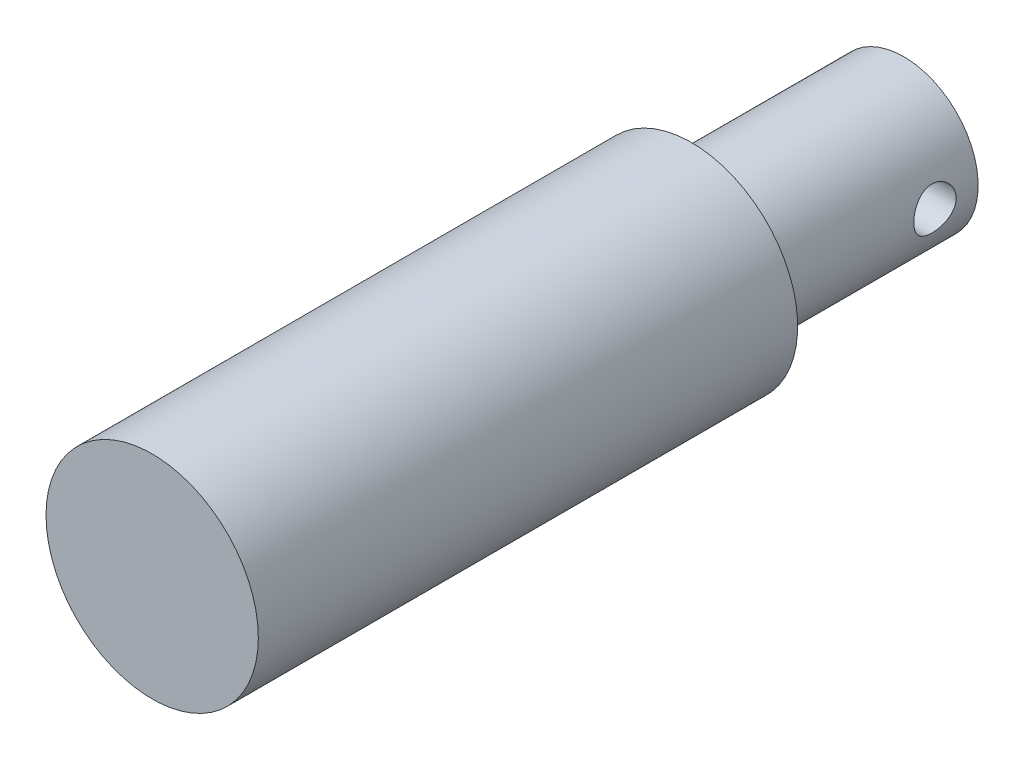
ISO-10303-21;
HEADER;
FILE_DESCRIPTION(('STEP AP214'),'2;1');
FILE_NAME('part.step','',(''),(''),'','','');
FILE_SCHEMA(('AUTOMOTIVE_DESIGN { 1 0 10303 214 1 1 1 1 }'));
ENDSEC;
DATA;
#1=APPLICATION_CONTEXT('core data for automotive mechanical design processes');
#2=APPLICATION_PROTOCOL_DEFINITION('international standard','automotive_design',2000,#1);
#3=PRODUCT_CONTEXT('',#1,'mechanical');
#4=PRODUCT('Part','Part','',(#3));
#5=PRODUCT_RELATED_PRODUCT_CATEGORY('part','',(#4));
#6=PRODUCT_DEFINITION_FORMATION('','',#4);
#7=PRODUCT_DEFINITION_CONTEXT('part definition',#1,'design');
#8=PRODUCT_DEFINITION('design','',#6,#7);
#9=PRODUCT_DEFINITION_SHAPE('','',#8);
#10=(LENGTH_UNIT() NAMED_UNIT(*) SI_UNIT(.MILLI.,.METRE.));
#11=(NAMED_UNIT(*) PLANE_ANGLE_UNIT() SI_UNIT($,.RADIAN.));
#12=(NAMED_UNIT(*) SI_UNIT($,.STERADIAN.) SOLID_ANGLE_UNIT());
#13=UNCERTAINTY_MEASURE_WITH_UNIT(LENGTH_MEASURE(1.E-05),#10,'distance_accuracy_value','');
#14=(GEOMETRIC_REPRESENTATION_CONTEXT(3) GLOBAL_UNCERTAINTY_ASSIGNED_CONTEXT((#13)) GLOBAL_UNIT_ASSIGNED_CONTEXT((#10,
#11,#12)) REPRESENTATION_CONTEXT('',''));
#15=CARTESIAN_POINT('',(0.,0.,0.));
#16=DIRECTION('',(0.,0.,1.));
#17=DIRECTION('',(1.,0.,0.));
#18=AXIS2_PLACEMENT_3D('',#15,#16,#17);
#19=CARTESIAN_POINT('',(0.,0.,35.4));
#20=DIRECTION('',(0.,0.,-1.));
#21=DIRECTION('',(-1.,0.,0.));
#22=AXIS2_PLACEMENT_3D('',#19,#20,#21);
#23=CYLINDRICAL_SURFACE('',#22,5.);
#24=CARTESIAN_POINT('',(0.,0.,35.4));
#25=DIRECTION('',(0.,0.,1.));
#26=DIRECTION('',(1.,0.,0.));
#27=AXIS2_PLACEMENT_3D('',#24,#25,#26);
#28=CIRCLE('',#27,5.);
#29=CARTESIAN_POINT('',(5.,0.,35.4));
#30=VERTEX_POINT('',#29);
#31=EDGE_CURVE('E11',#30,#30,#28,.T.);
#32=ORIENTED_EDGE('',*,*,#31,.F.);
#33=EDGE_LOOP('',(#32));
#34=FACE_BOUND('',#33,.T.);
#35=CARTESIAN_POINT('',(0.,0.,10.));
#36=DIRECTION('',(0.,0.,-1.));
#37=DIRECTION('',(-1.,0.,0.));
#38=AXIS2_PLACEMENT_3D('',#35,#36,#37);
#39=CIRCLE('',#38,5.);
#40=CARTESIAN_POINT('',(-5.,0.,10.));
#41=VERTEX_POINT('',#40);
#42=EDGE_CURVE('E35',#41,#41,#39,.T.);
#43=ORIENTED_EDGE('',*,*,#42,.F.);
#44=EDGE_LOOP('',(#43));
#45=FACE_BOUND('',#44,.T.);
#46=ADVANCED_FACE('F32',(#34,#45),#23,.T.);
#47=CARTESIAN_POINT('',(0.,0.,35.4));
#48=DIRECTION('',(0.,0.,1.));
#49=DIRECTION('',(1.,0.,0.));
#50=AXIS2_PLACEMENT_3D('',#47,#48,#49);
#51=PLANE('',#50);
#52=ORIENTED_EDGE('',*,*,#31,.T.);
#53=EDGE_LOOP('',(#52));
#54=FACE_BOUND('',#53,.T.);
#55=ADVANCED_FACE('F69',(#54),#51,.T.);
#56=CARTESIAN_POINT('',(0.,0.,10.));
#57=DIRECTION('',(0.,0.,-1.));
#58=DIRECTION('',(-1.,0.,0.));
#59=AXIS2_PLACEMENT_3D('',#56,#57,#58);
#60=PLANE('',#59);
#61=CARTESIAN_POINT('',(0.,0.,10.));
#62=DIRECTION('',(0.,0.,-1.));
#63=DIRECTION('',(-1.,0.,0.));
#64=AXIS2_PLACEMENT_3D('',#61,#62,#63);
#65=CIRCLE('',#64,3.5);
#66=CARTESIAN_POINT('',(-3.5,0.,10.));
#67=VERTEX_POINT('',#66);
#68=EDGE_CURVE('E54',#67,#67,#65,.T.);
#69=ORIENTED_EDGE('',*,*,#68,.F.);
#70=EDGE_LOOP('',(#69));
#71=FACE_BOUND('',#70,.T.);
#72=ORIENTED_EDGE('',*,*,#42,.T.);
#73=EDGE_LOOP('',(#72));
#74=FACE_BOUND('',#73,.T.);
#75=ADVANCED_FACE('F65',(#71,#74),#60,.T.);
#76=CARTESIAN_POINT('',(0.,0.,10.));
#77=DIRECTION('',(0.,0.,-1.));
#78=DIRECTION('',(-1.,0.,0.));
#79=AXIS2_PLACEMENT_3D('',#76,#77,#78);
#80=CYLINDRICAL_SURFACE('',#79,3.5);
#81=CARTESIAN_POINT('',(3.5,0.,1.03141713555161));
#82=CARTESIAN_POINT('',(3.49999934647171,-0.0549774511886257,1.03141810533258));
#83=CARTESIAN_POINT('',(3.49869208701023,-0.109964873936291,1.03596603003966));
#84=CARTESIAN_POINT('',(3.49360452972549,-0.218345995598494,1.05399927060276));
#85=CARTESIAN_POINT('',(3.48982329605034,-0.271739083414807,1.06748796858865));
#86=CARTESIAN_POINT('',(3.48020345674544,-0.375352150368936,1.10292115475986));
#87=CARTESIAN_POINT('',(3.474367720532,-0.425576440424113,1.12485385362759));
#88=CARTESIAN_POINT('',(3.46124989158242,-0.521634380564634,1.17650613129077));
#89=CARTESIAN_POINT('',(3.45396764753901,-0.567467570589077,1.20622652479675));
#90=CARTESIAN_POINT('',(3.43852367312902,-0.654647223429478,1.2734346408881));
#91=CARTESIAN_POINT('',(3.4303452097302,-0.69586186119049,1.31108951247939));
#92=CARTESIAN_POINT('',(3.41413367457396,-0.771485678962155,1.3927410071203));
#93=CARTESIAN_POINT('',(3.40610062478084,-0.805893838538838,1.43673857936717));
#94=CARTESIAN_POINT('',(3.39091507439313,-0.867598950032228,1.53091392694762));
#95=CARTESIAN_POINT('',(3.38378351259108,-0.894739105517028,1.58119812808614));
#96=CARTESIAN_POINT('',(3.37145671914235,-0.940125852769615,1.68585314142489));
#97=CARTESIAN_POINT('',(3.36626107099664,-0.958374357777524,1.7402230715792));
#98=CARTESIAN_POINT('',(3.35856804120241,-0.984992165068876,1.85003451713566));
#99=CARTESIAN_POINT('',(3.35600489366891,-0.993602766016075,1.90541281695072));
#100=CARTESIAN_POINT('',(3.35367104182518,-1.00145333894795,2.01688270979323));
#101=CARTESIAN_POINT('',(3.35389973075333,-1.00069534704803,2.07297414518475));
#102=CARTESIAN_POINT('',(3.35706517184156,-0.990020673813953,2.1823514412784));
#103=CARTESIAN_POINT('',(3.35991391343389,-0.980401628641805,2.23566931114164));
#104=CARTESIAN_POINT('',(3.36785674196985,-0.952756930429097,2.33990074536575));
#105=CARTESIAN_POINT('',(3.37295103189705,-0.934730517406289,2.39081409191195));
#106=CARTESIAN_POINT('',(3.38488431756517,-0.890553405689019,2.48954025776742));
#107=CARTESIAN_POINT('',(3.39174458202416,-0.864302755864395,2.53730567175242));
#108=CARTESIAN_POINT('',(3.40642608441438,-0.804491895839434,2.62785541615833));
#109=CARTESIAN_POINT('',(3.41424753611067,-0.770930058366727,2.67063863441907));
#110=CARTESIAN_POINT('',(3.43033125328062,-0.695951998365101,2.75170332335478));
#111=CARTESIAN_POINT('',(3.43859902286152,-0.654287437422663,2.78975437353522));
#112=CARTESIAN_POINT('',(3.45438123609203,-0.565066141193113,2.85838013737175));
#113=CARTESIAN_POINT('',(3.46189564068921,-0.517509100740946,2.88895446357246));
#114=CARTESIAN_POINT('',(3.47538264032742,-0.417461536545722,2.94188150293862));
#115=CARTESIAN_POINT('',(3.48134637748612,-0.364944908905002,2.9641872789537));
#116=CARTESIAN_POINT('',(3.49099625743795,-0.256696614983734,2.99958408126002));
#117=CARTESIAN_POINT('',(3.49468297428128,-0.200965762905073,3.01267743017424));
#118=CARTESIAN_POINT('',(3.49927437257336,-0.0898331943221743,3.02890377840633));
#119=CARTESIAN_POINT('',(3.50026636425301,-0.0344806734302531,3.03234948323812));
#120=CARTESIAN_POINT('',(3.49961042353544,0.0760132634027915,3.03005350240109));
#121=CARTESIAN_POINT('',(3.49796280790308,0.131154703878553,3.02431291912865));
#122=CARTESIAN_POINT('',(3.49226963342609,0.238509316715159,3.00406191339347));
#123=CARTESIAN_POINT('',(3.48827306508862,0.290759105867428,2.98973054488989));
#124=CARTESIAN_POINT('',(3.4783399937092,0.392104343102815,2.95291688455929));
#125=CARTESIAN_POINT('',(3.47240326632854,0.441199425624338,2.930433650107));
#126=CARTESIAN_POINT('',(3.45904980584657,0.536020842560038,2.87740546722898));
#127=CARTESIAN_POINT('',(3.45160381589487,0.581651243270127,2.84669653613871));
#128=CARTESIAN_POINT('',(3.43608973548903,0.667219264029655,2.77829088257629));
#129=CARTESIAN_POINT('',(3.42802150376367,0.707155585421215,2.74059257052017));
#130=CARTESIAN_POINT('',(3.41184309815947,0.781553214170354,2.65781246452601));
#131=CARTESIAN_POINT('',(3.40374018433795,0.81579271370477,2.61252949776876));
#132=CARTESIAN_POINT('',(3.38869447362751,0.876197658032581,2.5166858412426));
#133=CARTESIAN_POINT('',(3.3817516363796,0.902363383738855,2.4661253351784));
#134=CARTESIAN_POINT('',(3.36989325638715,0.945687270594172,2.36137153005573));
#135=CARTESIAN_POINT('',(3.36496700079018,0.962893166212217,2.30719925376526));
#136=CARTESIAN_POINT('',(3.35771228398834,0.987897250353705,2.19656216772441));
#137=CARTESIAN_POINT('',(3.35538303564047,0.995698289511611,2.1400980580006));
#138=CARTESIAN_POINT('',(3.35365851547575,1.00149012123096,2.02876911909083));
#139=CARTESIAN_POINT('',(3.35415580399703,0.999840138221142,1.97392438327531));
#140=CARTESIAN_POINT('',(3.35777298607399,0.987623554788215,1.86532977021872));
#141=CARTESIAN_POINT('',(3.36089279211716,0.977057251899602,1.8115798565051));
#142=CARTESIAN_POINT('',(3.36933488579116,0.947529844083142,1.70722794996784));
#143=CARTESIAN_POINT('',(3.37463438524179,0.928655458931764,1.65659944204616));
#144=CARTESIAN_POINT('',(3.38683651421364,0.883114746507969,1.55918776830536));
#145=CARTESIAN_POINT('',(3.3937394274128,0.856447040215778,1.51240528491495));
#146=CARTESIAN_POINT('',(3.40865834474881,0.795032732674125,1.42232537464898));
#147=CARTESIAN_POINT('',(3.41670381589509,0.760046138613655,1.37919643988064));
#148=CARTESIAN_POINT('',(3.43284922546139,0.683429920189678,1.29930518764669));
#149=CARTESIAN_POINT('',(3.4409491770859,0.64179862536428,1.2625444759962));
#150=CARTESIAN_POINT('',(3.45653979786176,0.551787160432695,1.1954985433883));
#151=CARTESIAN_POINT('',(3.46400950518705,0.50326125117989,1.16540364191679));
#152=CARTESIAN_POINT('',(3.47725697888987,0.401625264823331,1.1138442430406));
#153=CARTESIAN_POINT('',(3.48303566935144,0.34851771205737,1.09237502958507));
#154=CARTESIAN_POINT('',(3.49163672362653,0.246458157667517,1.06099335985388));
#155=CARTESIAN_POINT('',(3.49474842181038,0.197881503812195,1.04993036720933));
#156=CARTESIAN_POINT('',(3.49893021926074,0.0995391843931838,1.03514230693053));
#157=CARTESIAN_POINT('',(3.50000059166997,0.049773678808046,1.03141625756316));
#158=CARTESIAN_POINT('',(3.5,0.,1.03141713555161));
#159=B_SPLINE_CURVE_WITH_KNOTS('',3,(#81,#82,#83,#84,#85,#86,#87,#88,#89,#90,#91,#92,#93,#94,
#95,#96,#97,#98,#99,#100,#101,#102,#103,#104,#105,#106,#107,#108,#109,#110,#111,#112,#113,#114,
#115,#116,#117,#118,#119,#120,#121,#122,#123,#124,#125,#126,#127,#128,#129,#130,#131,#132,#133,
#134,#135,#136,#137,#138,#139,#140,#141,#142,#143,#144,#145,#146,#147,#148,#149,#150,#151,#152,
#153,#154,#155,#156,#157,#158),.UNSPECIFIED.,.T.,.F.,(4,2,2,2,2,2,2,2,2,2,2,2,2,2,2,2,2,2,2,2,2,
2,2,2,2,2,2,2,2,2,2,2,2,2,2,2,2,2,4),(0.,0.164749656271172,0.32956166989759,0.494144406447671,
0.658744367717579,0.827239057653907,0.995758989368567,1.16766537650029,1.33953475772405,
1.50699754929408,1.67442394611628,1.83642392910678,1.99843855889074,2.16250401641616,
2.32660602784683,2.49689250297262,2.66718780073736,2.83843550548235,3.00964002003317,
3.17522728845111,3.34079468713335,3.50302570235771,3.66527548283776,3.83103762668237,
3.99683751589905,4.16806052438178,4.3392775747866,4.50957286677749,4.6798165288708,
4.84363340801449,5.00744482086202,5.16958548138845,5.33175484992001,5.49933828438395,
5.66696391547449,5.83888989478295,6.01072174610257,6.15989734012186,6.30905297207072),.UNSPECIFIED.);
#160=CARTESIAN_POINT('',(3.5,0.,1.03141713555161));
#161=VERTEX_POINT('',#160);
#162=EDGE_CURVE('E48',#161,#161,#159,.T.);
#163=ORIENTED_EDGE('',*,*,#162,.T.);
#164=EDGE_LOOP('',(#163));
#165=FACE_BOUND('',#164,.T.);
#166=ORIENTED_EDGE('',*,*,#68,.T.);
#167=EDGE_LOOP('',(#166));
#168=FACE_BOUND('',#167,.T.);
#169=CARTESIAN_POINT('',(0.,0.,0.));
#170=DIRECTION('',(0.,0.,-1.));
#171=DIRECTION('',(-1.,0.,0.));
#172=AXIS2_PLACEMENT_3D('',#169,#170,#171);
#173=CIRCLE('',#172,3.5);
#174=CARTESIAN_POINT('',(-3.5,0.,0.));
#175=VERTEX_POINT('',#174);
#176=EDGE_CURVE('E46',#175,#175,#173,.T.);
#177=ORIENTED_EDGE('',*,*,#176,.F.);
#178=EDGE_LOOP('',(#177));
#179=FACE_BOUND('',#178,.T.);
#180=CARTESIAN_POINT('',(-3.5,0.,1.03141713555161));
#181=CARTESIAN_POINT('',(-3.49999934647171,0.0549774511886257,1.03141810533258));
#182=CARTESIAN_POINT('',(-3.49869208701023,0.109964873936291,1.03596603003966));
#183=CARTESIAN_POINT('',(-3.49360452972549,0.218345995598494,1.05399927060276));
#184=CARTESIAN_POINT('',(-3.48982329605034,0.271739083414807,1.06748796858865));
#185=CARTESIAN_POINT('',(-3.48020345674544,0.375352150368936,1.10292115475986));
#186=CARTESIAN_POINT('',(-3.474367720532,0.425576440424113,1.12485385362759));
#187=CARTESIAN_POINT('',(-3.46124989158242,0.521634380564634,1.17650613129077));
#188=CARTESIAN_POINT('',(-3.45396764753901,0.567467570589077,1.20622652479675));
#189=CARTESIAN_POINT('',(-3.43852367312902,0.654647223429478,1.2734346408881));
#190=CARTESIAN_POINT('',(-3.4303452097302,0.69586186119049,1.31108951247939));
#191=CARTESIAN_POINT('',(-3.41413367457396,0.771485678962155,1.3927410071203));
#192=CARTESIAN_POINT('',(-3.40610062478084,0.805893838538838,1.43673857936717));
#193=CARTESIAN_POINT('',(-3.39091507439313,0.867598950032228,1.53091392694762));
#194=CARTESIAN_POINT('',(-3.38378351259108,0.894739105517028,1.58119812808614));
#195=CARTESIAN_POINT('',(-3.37145671914235,0.940125852769615,1.68585314142489));
#196=CARTESIAN_POINT('',(-3.36626107099664,0.958374357777524,1.7402230715792));
#197=CARTESIAN_POINT('',(-3.35856804120241,0.984992165068876,1.85003451713566));
#198=CARTESIAN_POINT('',(-3.35600489366891,0.993602766016075,1.90541281695072));
#199=CARTESIAN_POINT('',(-3.35367104182518,1.00145333894795,2.01688270979323));
#200=CARTESIAN_POINT('',(-3.35389973075333,1.00069534704803,2.07297414518475));
#201=CARTESIAN_POINT('',(-3.35706517184156,0.990020673813953,2.1823514412784));
#202=CARTESIAN_POINT('',(-3.35991391343389,0.980401628641805,2.23566931114164));
#203=CARTESIAN_POINT('',(-3.36785674196985,0.952756930429097,2.33990074536575));
#204=CARTESIAN_POINT('',(-3.37295103189705,0.934730517406289,2.39081409191195));
#205=CARTESIAN_POINT('',(-3.38488431756517,0.890553405689019,2.48954025776742));
#206=CARTESIAN_POINT('',(-3.39174458202416,0.864302755864395,2.53730567175242));
#207=CARTESIAN_POINT('',(-3.40642608441438,0.804491895839434,2.62785541615833));
#208=CARTESIAN_POINT('',(-3.41424753611067,0.770930058366727,2.67063863441907));
#209=CARTESIAN_POINT('',(-3.43033125328062,0.695951998365101,2.75170332335478));
#210=CARTESIAN_POINT('',(-3.43859902286152,0.654287437422663,2.78975437353522));
#211=CARTESIAN_POINT('',(-3.45438123609203,0.565066141193113,2.85838013737175));
#212=CARTESIAN_POINT('',(-3.46189564068921,0.517509100740946,2.88895446357246));
#213=CARTESIAN_POINT('',(-3.47538264032742,0.417461536545722,2.94188150293862));
#214=CARTESIAN_POINT('',(-3.48134637748612,0.364944908905002,2.9641872789537));
#215=CARTESIAN_POINT('',(-3.49099625743795,0.256696614983734,2.99958408126002));
#216=CARTESIAN_POINT('',(-3.49468297428128,0.200965762905073,3.01267743017424));
#217=CARTESIAN_POINT('',(-3.49927437257336,0.0898331943221743,3.02890377840633));
#218=CARTESIAN_POINT('',(-3.50026636425301,0.0344806734302531,3.03234948323812));
#219=CARTESIAN_POINT('',(-3.49961042353544,-0.0760132634027915,3.03005350240109));
#220=CARTESIAN_POINT('',(-3.49796280790308,-0.131154703878553,3.02431291912865));
#221=CARTESIAN_POINT('',(-3.49226963342609,-0.238509316715159,3.00406191339347));
#222=CARTESIAN_POINT('',(-3.48827306508862,-0.290759105867428,2.98973054488989));
#223=CARTESIAN_POINT('',(-3.4783399937092,-0.392104343102815,2.95291688455929));
#224=CARTESIAN_POINT('',(-3.47240326632854,-0.441199425624338,2.930433650107));
#225=CARTESIAN_POINT('',(-3.45904980584657,-0.536020842560038,2.87740546722898));
#226=CARTESIAN_POINT('',(-3.45160381589487,-0.581651243270127,2.84669653613871));
#227=CARTESIAN_POINT('',(-3.43608973548903,-0.667219264029655,2.77829088257629));
#228=CARTESIAN_POINT('',(-3.42802150376367,-0.707155585421215,2.74059257052017));
#229=CARTESIAN_POINT('',(-3.41184309815947,-0.781553214170354,2.65781246452601));
#230=CARTESIAN_POINT('',(-3.40374018433795,-0.81579271370477,2.61252949776876));
#231=CARTESIAN_POINT('',(-3.38869447362751,-0.876197658032581,2.5166858412426));
#232=CARTESIAN_POINT('',(-3.3817516363796,-0.902363383738855,2.4661253351784));
#233=CARTESIAN_POINT('',(-3.36989325638715,-0.945687270594172,2.36137153005573));
#234=CARTESIAN_POINT('',(-3.36496700079018,-0.962893166212217,2.30719925376526));
#235=CARTESIAN_POINT('',(-3.35771228398834,-0.987897250353705,2.19656216772441));
#236=CARTESIAN_POINT('',(-3.35538303564047,-0.995698289511611,2.1400980580006));
#237=CARTESIAN_POINT('',(-3.35365851547575,-1.00149012123096,2.02876911909083));
#238=CARTESIAN_POINT('',(-3.35415580399703,-0.999840138221142,1.97392438327531));
#239=CARTESIAN_POINT('',(-3.35777298607399,-0.987623554788215,1.86532977021872));
#240=CARTESIAN_POINT('',(-3.36089279211716,-0.977057251899602,1.8115798565051));
#241=CARTESIAN_POINT('',(-3.36933488579116,-0.947529844083142,1.70722794996784));
#242=CARTESIAN_POINT('',(-3.37463438524179,-0.928655458931764,1.65659944204616));
#243=CARTESIAN_POINT('',(-3.38683651421364,-0.883114746507969,1.55918776830536));
#244=CARTESIAN_POINT('',(-3.3937394274128,-0.856447040215778,1.51240528491495));
#245=CARTESIAN_POINT('',(-3.40865834474881,-0.795032732674125,1.42232537464898));
#246=CARTESIAN_POINT('',(-3.41670381589509,-0.760046138613655,1.37919643988064));
#247=CARTESIAN_POINT('',(-3.43284922546139,-0.683429920189678,1.29930518764669));
#248=CARTESIAN_POINT('',(-3.4409491770859,-0.64179862536428,1.2625444759962));
#249=CARTESIAN_POINT('',(-3.45653979786176,-0.551787160432695,1.1954985433883));
#250=CARTESIAN_POINT('',(-3.46400950518705,-0.50326125117989,1.16540364191679));
#251=CARTESIAN_POINT('',(-3.47725697888987,-0.401625264823331,1.1138442430406));
#252=CARTESIAN_POINT('',(-3.48303566935144,-0.34851771205737,1.09237502958507));
#253=CARTESIAN_POINT('',(-3.49163672362653,-0.246458157667517,1.06099335985388));
#254=CARTESIAN_POINT('',(-3.49474842181038,-0.197881503812195,1.04993036720933));
#255=CARTESIAN_POINT('',(-3.49893021926074,-0.0995391843931838,1.03514230693053));
#256=CARTESIAN_POINT('',(-3.50000059166997,-0.049773678808046,1.03141625756316));
#257=CARTESIAN_POINT('',(-3.5,0.,1.03141713555161));
#258=B_SPLINE_CURVE_WITH_KNOTS('',3,(#180,#181,#182,#183,#184,#185,#186,#187,#188,#189,#190,
#191,#192,#193,#194,#195,#196,#197,#198,#199,#200,#201,#202,#203,#204,#205,#206,#207,#208,#209,
#210,#211,#212,#213,#214,#215,#216,#217,#218,#219,#220,#221,#222,#223,#224,#225,#226,#227,#228,
#229,#230,#231,#232,#233,#234,#235,#236,#237,#238,#239,#240,#241,#242,#243,#244,#245,#246,#247,
#248,#249,#250,#251,#252,#253,#254,#255,#256,#257),.UNSPECIFIED.,.T.,.F.,(4,2,2,2,2,2,2,2,2,2,2,
2,2,2,2,2,2,2,2,2,2,2,2,2,2,2,2,2,2,2,2,2,2,2,2,2,2,2,4),(0.,0.164749656271172,0.32956166989759,
0.494144406447671,0.658744367717579,0.827239057653907,0.995758989368567,1.16766537650029,
1.33953475772405,1.50699754929408,1.67442394611628,1.83642392910678,1.99843855889074,
2.16250401641616,2.32660602784683,2.49689250297262,2.66718780073736,2.83843550548235,
3.00964002003317,3.17522728845111,3.34079468713335,3.50302570235771,3.66527548283776,
3.83103762668237,3.99683751589905,4.16806052438178,4.3392775747866,4.50957286677749,
4.6798165288708,4.84363340801449,5.00744482086202,5.16958548138845,5.33175484992001,
5.49933828438395,5.66696391547449,5.83888989478295,6.01072174610257,6.15989734012186,
6.30905297207072),.UNSPECIFIED.);
#259=CARTESIAN_POINT('',(-3.5,0.,1.03141713555161));
#260=VERTEX_POINT('',#259);
#261=EDGE_CURVE('E43',#260,#260,#258,.T.);
#262=ORIENTED_EDGE('',*,*,#261,.T.);
#263=EDGE_LOOP('',(#262));
#264=FACE_BOUND('',#263,.T.);
#265=ADVANCED_FACE('F61',(#165,#168,#179,#264),#80,.T.);
#266=CARTESIAN_POINT('',(0.,0.,0.));
#267=DIRECTION('',(0.,0.,1.));
#268=DIRECTION('',(1.,0.,0.));
#269=AXIS2_PLACEMENT_3D('',#266,#267,#268);
#270=PLANE('',#269);
#271=ORIENTED_EDGE('',*,*,#176,.T.);
#272=EDGE_LOOP('',(#271));
#273=FACE_BOUND('',#272,.T.);
#274=ADVANCED_FACE('F64',(#273),#270,.F.);
#275=CARTESIAN_POINT('',(-5.,0.,2.03141713555161));
#276=DIRECTION('',(1.,0.,0.));
#277=DIRECTION('',(0.,0.,-1.));
#278=AXIS2_PLACEMENT_3D('',#275,#276,#277);
#279=CYLINDRICAL_SURFACE('',#278,1.);
#280=ORIENTED_EDGE('',*,*,#162,.F.);
#281=EDGE_LOOP('',(#280));
#282=FACE_BOUND('',#281,.T.);
#283=ORIENTED_EDGE('',*,*,#261,.F.);
#284=EDGE_LOOP('',(#283));
#285=FACE_BOUND('',#284,.T.);
#286=ADVANCED_FACE('F57',(#282,#285),#279,.F.);
#287=CLOSED_SHELL('',(#46,#55,#75,#265,#274,#286));
#288=MANIFOLD_SOLID_BREP('B2',#287);
#289=ADVANCED_BREP_SHAPE_REPRESENTATION('',(#18,#288),#14);
#290=SHAPE_DEFINITION_REPRESENTATION(#9,#289);
ENDSEC;
END-ISO-10303-21;
